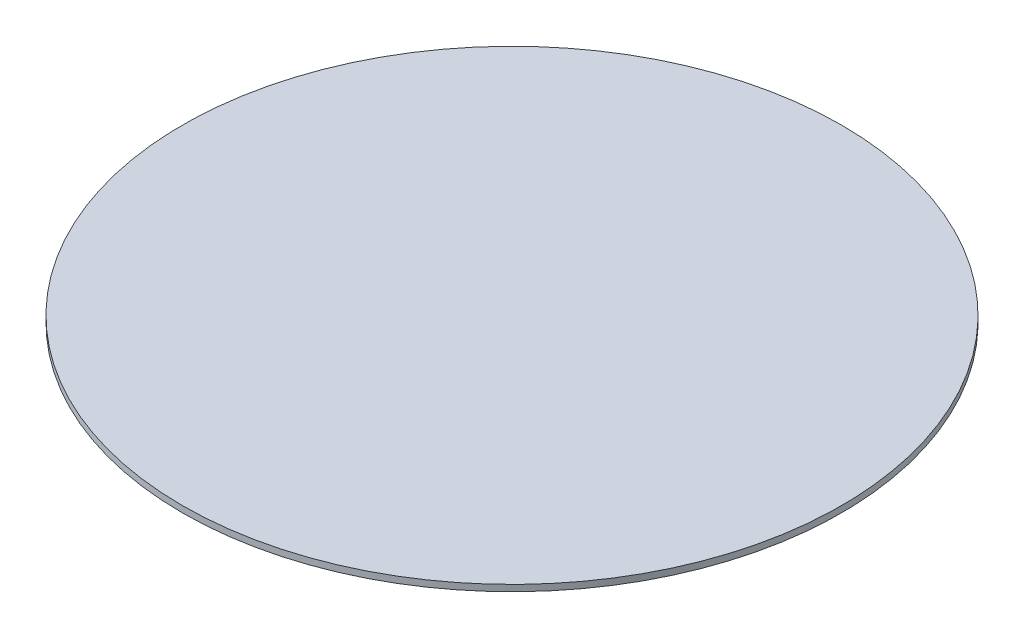
ISO-10303-21;
HEADER;
FILE_DESCRIPTION(('STEP AP214'),'2;1');
FILE_NAME('part.step','',(''),(''),'','','');
FILE_SCHEMA(('AUTOMOTIVE_DESIGN { 1 0 10303 214 1 1 1 1 }'));
ENDSEC;
DATA;
#1=APPLICATION_CONTEXT('core data for automotive mechanical design processes');
#2=APPLICATION_PROTOCOL_DEFINITION('international standard','automotive_design',2000,#1);
#3=PRODUCT_CONTEXT('',#1,'mechanical');
#4=PRODUCT('Part','Part','',(#3));
#5=PRODUCT_RELATED_PRODUCT_CATEGORY('part','',(#4));
#6=PRODUCT_DEFINITION_FORMATION('','',#4);
#7=PRODUCT_DEFINITION_CONTEXT('part definition',#1,'design');
#8=PRODUCT_DEFINITION('design','',#6,#7);
#9=PRODUCT_DEFINITION_SHAPE('','',#8);
#10=(LENGTH_UNIT() NAMED_UNIT(*) SI_UNIT(.MILLI.,.METRE.));
#11=(NAMED_UNIT(*) PLANE_ANGLE_UNIT() SI_UNIT($,.RADIAN.));
#12=(NAMED_UNIT(*) SI_UNIT($,.STERADIAN.) SOLID_ANGLE_UNIT());
#13=UNCERTAINTY_MEASURE_WITH_UNIT(LENGTH_MEASURE(1.E-05),#10,'distance_accuracy_value','');
#14=(GEOMETRIC_REPRESENTATION_CONTEXT(3) GLOBAL_UNCERTAINTY_ASSIGNED_CONTEXT((#13)) GLOBAL_UNIT_ASSIGNED_CONTEXT((#10,
#11,#12)) REPRESENTATION_CONTEXT('',''));
#15=CARTESIAN_POINT('',(0.,0.,0.));
#16=DIRECTION('',(0.,0.,1.));
#17=DIRECTION('',(1.,0.,0.));
#18=AXIS2_PLACEMENT_3D('',#15,#16,#17);
#19=CARTESIAN_POINT('',(0.,3.175,0.));
#20=DIRECTION('',(0.,-1.,0.));
#21=DIRECTION('',(0.,0.,-1.));
#22=AXIS2_PLACEMENT_3D('',#19,#20,#21);
#23=CYLINDRICAL_SURFACE('',#22,165.1);
#24=CARTESIAN_POINT('',(0.,3.175,0.));
#25=DIRECTION('',(0.,1.,0.));
#26=DIRECTION('',(0.,0.,1.));
#27=AXIS2_PLACEMENT_3D('',#24,#25,#26);
#28=CIRCLE('',#27,165.1);
#29=CARTESIAN_POINT('',(0.,3.175,165.1));
#30=VERTEX_POINT('',#29);
#31=EDGE_CURVE('E10',#30,#30,#28,.T.);
#32=ORIENTED_EDGE('',*,*,#31,.F.);
#33=EDGE_LOOP('',(#32));
#34=FACE_BOUND('',#33,.T.);
#35=CARTESIAN_POINT('',(0.,0.,0.));
#36=DIRECTION('',(0.,1.,0.));
#37=DIRECTION('',(0.,0.,1.));
#38=AXIS2_PLACEMENT_3D('',#35,#36,#37);
#39=CIRCLE('',#38,165.1);
#40=CARTESIAN_POINT('',(0.,0.,165.1));
#41=VERTEX_POINT('',#40);
#42=EDGE_CURVE('E33',#41,#41,#39,.T.);
#43=ORIENTED_EDGE('',*,*,#42,.T.);
#44=EDGE_LOOP('',(#43));
#45=FACE_BOUND('',#44,.T.);
#46=ADVANCED_FACE('F30',(#34,#45),#23,.T.);
#47=CARTESIAN_POINT('',(0.,3.175,0.));
#48=DIRECTION('',(0.,1.,0.));
#49=DIRECTION('',(0.,0.,1.));
#50=AXIS2_PLACEMENT_3D('',#47,#48,#49);
#51=PLANE('',#50);
#52=ORIENTED_EDGE('',*,*,#31,.T.);
#53=EDGE_LOOP('',(#52));
#54=FACE_BOUND('',#53,.T.);
#55=ADVANCED_FACE('F45',(#54),#51,.T.);
#56=CARTESIAN_POINT('',(0.,0.,0.));
#57=DIRECTION('',(0.,1.,0.));
#58=DIRECTION('',(0.,0.,1.));
#59=AXIS2_PLACEMENT_3D('',#56,#57,#58);
#60=PLANE('',#59);
#61=ORIENTED_EDGE('',*,*,#42,.F.);
#62=EDGE_LOOP('',(#61));
#63=FACE_BOUND('',#62,.T.);
#64=ADVANCED_FACE('F43',(#63),#60,.F.);
#65=CLOSED_SHELL('',(#46,#55,#64));
#66=MANIFOLD_SOLID_BREP('B2',#65);
#67=ADVANCED_BREP_SHAPE_REPRESENTATION('',(#18,#66),#14);
#68=SHAPE_DEFINITION_REPRESENTATION(#9,#67);
ENDSEC;
END-ISO-10303-21;
